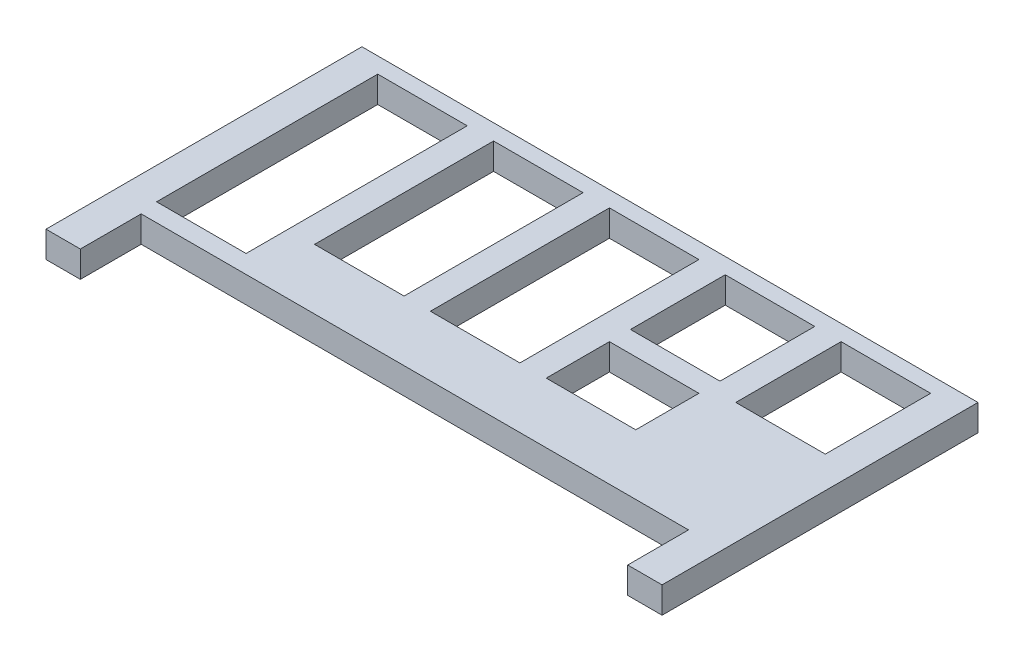
ISO-10303-21;
HEADER;
FILE_DESCRIPTION(('STEP AP214'),'2;1');
FILE_NAME('part.step','',(''),(''),'','','');
FILE_SCHEMA(('AUTOMOTIVE_DESIGN { 1 0 10303 214 1 1 1 1 }'));
ENDSEC;
DATA;
#1=APPLICATION_CONTEXT('core data for automotive mechanical design processes');
#2=APPLICATION_PROTOCOL_DEFINITION('international standard','automotive_design',2000,#1);
#3=PRODUCT_CONTEXT('',#1,'mechanical');
#4=PRODUCT('Part','Part','',(#3));
#5=PRODUCT_RELATED_PRODUCT_CATEGORY('part','',(#4));
#6=PRODUCT_DEFINITION_FORMATION('','',#4);
#7=PRODUCT_DEFINITION_CONTEXT('part definition',#1,'design');
#8=PRODUCT_DEFINITION('design','',#6,#7);
#9=PRODUCT_DEFINITION_SHAPE('','',#8);
#10=(LENGTH_UNIT() NAMED_UNIT(*) SI_UNIT(.MILLI.,.METRE.));
#11=(NAMED_UNIT(*) PLANE_ANGLE_UNIT() SI_UNIT($,.RADIAN.));
#12=(NAMED_UNIT(*) SI_UNIT($,.STERADIAN.) SOLID_ANGLE_UNIT());
#13=UNCERTAINTY_MEASURE_WITH_UNIT(LENGTH_MEASURE(1.E-05),#10,'distance_accuracy_value','');
#14=(GEOMETRIC_REPRESENTATION_CONTEXT(3) GLOBAL_UNCERTAINTY_ASSIGNED_CONTEXT((#13)) GLOBAL_UNIT_ASSIGNED_CONTEXT((#10,
#11,#12)) REPRESENTATION_CONTEXT('',''));
#15=CARTESIAN_POINT('',(0.,0.,0.));
#16=DIRECTION('',(0.,0.,1.));
#17=DIRECTION('',(1.,0.,0.));
#18=AXIS2_PLACEMENT_3D('',#15,#16,#17);
#19=CARTESIAN_POINT('',(0.,5.,-5.));
#20=DIRECTION('',(0.,0.,-1.));
#21=DIRECTION('',(-1.,0.,0.));
#22=AXIS2_PLACEMENT_3D('',#19,#20,#21);
#23=PLANE('',#22);
#24=DIRECTION('',(1.,0.,0.));
#25=VECTOR('',#24,1.);
#26=CARTESIAN_POINT('',(0.,0.,-5.));
#27=LINE('',#26,#25);
#28=CARTESIAN_POINT('',(13.5,0.,-5.));
#29=VERTEX_POINT('',#28);
#30=CARTESIAN_POINT('',(30.5,0.,-5.));
#31=VERTEX_POINT('',#30);
#32=EDGE_CURVE('E354',#29,#31,#27,.T.);
#33=ORIENTED_EDGE('',*,*,#32,.T.);
#34=DIRECTION('',(0.,-1.,0.));
#35=VECTOR('',#34,1.);
#36=CARTESIAN_POINT('',(30.5,5.,-5.));
#37=LINE('',#36,#35);
#38=CARTESIAN_POINT('',(30.5,5.,-5.));
#39=VERTEX_POINT('',#38);
#40=EDGE_CURVE('E11',#39,#31,#37,.T.);
#41=ORIENTED_EDGE('',*,*,#40,.F.);
#42=DIRECTION('',(1.,0.,0.));
#43=VECTOR('',#42,1.);
#44=CARTESIAN_POINT('',(0.,5.,-5.));
#45=LINE('',#44,#43);
#46=CARTESIAN_POINT('',(13.5,5.,-5.));
#47=VERTEX_POINT('',#46);
#48=EDGE_CURVE('E257',#47,#39,#45,.T.);
#49=ORIENTED_EDGE('',*,*,#48,.F.);
#50=DIRECTION('',(0.,-1.,0.));
#51=VECTOR('',#50,1.);
#52=CARTESIAN_POINT('',(13.5,5.,-5.));
#53=LINE('',#52,#51);
#54=EDGE_CURVE('E53',#47,#29,#53,.T.);
#55=ORIENTED_EDGE('',*,*,#54,.T.);
#56=EDGE_LOOP('',(#33,#41,#49,#55));
#57=FACE_BOUND('',#56,.T.);
#58=ADVANCED_FACE('F34',(#57),#23,.F.);
#59=CARTESIAN_POINT('',(30.5,5.,0.));
#60=DIRECTION('',(1.,0.,0.));
#61=DIRECTION('',(0.,0.,-1.));
#62=AXIS2_PLACEMENT_3D('',#59,#60,#61);
#63=PLANE('',#62);
#64=DIRECTION('',(0.,0.,1.));
#65=VECTOR('',#64,1.);
#66=CARTESIAN_POINT('',(30.5,0.,0.));
#67=LINE('',#66,#65);
#68=CARTESIAN_POINT('',(30.5,0.,7.));
#69=VERTEX_POINT('',#68);
#70=EDGE_CURVE('E263',#31,#69,#67,.T.);
#71=ORIENTED_EDGE('',*,*,#70,.T.);
#72=DIRECTION('',(0.,-1.,0.));
#73=VECTOR('',#72,1.);
#74=CARTESIAN_POINT('',(30.5,5.,7.));
#75=LINE('',#74,#73);
#76=CARTESIAN_POINT('',(30.5,5.,7.));
#77=VERTEX_POINT('',#76);
#78=EDGE_CURVE('E44',#77,#69,#75,.T.);
#79=ORIENTED_EDGE('',*,*,#78,.F.);
#80=DIRECTION('',(0.,0.,1.));
#81=VECTOR('',#80,1.);
#82=CARTESIAN_POINT('',(30.5,5.,0.));
#83=LINE('',#82,#81);
#84=EDGE_CURVE('E251',#39,#77,#83,.T.);
#85=ORIENTED_EDGE('',*,*,#84,.F.);
#86=ORIENTED_EDGE('',*,*,#40,.T.);
#87=EDGE_LOOP('',(#71,#79,#85,#86));
#88=FACE_BOUND('',#87,.T.);
#89=ADVANCED_FACE('F262',(#88),#63,.F.);
#90=CARTESIAN_POINT('',(0.,5.,7.));
#91=DIRECTION('',(0.,0.,-1.));
#92=DIRECTION('',(-1.,0.,0.));
#93=AXIS2_PLACEMENT_3D('',#90,#91,#92);
#94=PLANE('',#93);
#95=DIRECTION('',(1.,0.,0.));
#96=VECTOR('',#95,1.);
#97=CARTESIAN_POINT('',(0.,0.,7.));
#98=LINE('',#97,#96);
#99=CARTESIAN_POINT('',(13.5,0.,7.));
#100=VERTEX_POINT('',#99);
#101=EDGE_CURVE('E357',#100,#69,#98,.T.);
#102=ORIENTED_EDGE('',*,*,#101,.F.);
#103=DIRECTION('',(0.,-1.,0.));
#104=VECTOR('',#103,1.);
#105=CARTESIAN_POINT('',(13.5,5.,7.));
#106=LINE('',#105,#104);
#107=CARTESIAN_POINT('',(13.5,5.,7.));
#108=VERTEX_POINT('',#107);
#109=EDGE_CURVE('E151',#108,#100,#106,.T.);
#110=ORIENTED_EDGE('',*,*,#109,.F.);
#111=DIRECTION('',(1.,0.,0.));
#112=VECTOR('',#111,1.);
#113=CARTESIAN_POINT('',(0.,5.,7.));
#114=LINE('',#113,#112);
#115=EDGE_CURVE('E256',#108,#77,#114,.T.);
#116=ORIENTED_EDGE('',*,*,#115,.T.);
#117=ORIENTED_EDGE('',*,*,#78,.T.);
#118=EDGE_LOOP('',(#102,#110,#116,#117));
#119=FACE_BOUND('',#118,.T.);
#120=ADVANCED_FACE('F267',(#119),#94,.T.);
#121=CARTESIAN_POINT('',(-35.5,5.,0.));
#122=DIRECTION('',(-1.,0.,0.));
#123=DIRECTION('',(0.,0.,1.));
#124=AXIS2_PLACEMENT_3D('',#121,#122,#123);
#125=PLANE('',#124);
#126=DIRECTION('',(0.,0.,-1.));
#127=VECTOR('',#126,1.);
#128=CARTESIAN_POINT('',(-35.5,0.,0.));
#129=LINE('',#128,#127);
#130=CARTESIAN_POINT('',(-35.5,0.,15.));
#131=VERTEX_POINT('',#130);
#132=CARTESIAN_POINT('',(-35.5,0.,-27.));
#133=VERTEX_POINT('',#132);
#134=EDGE_CURVE('E342',#131,#133,#129,.T.);
#135=ORIENTED_EDGE('',*,*,#134,.F.);
#136=DIRECTION('',(0.,-1.,0.));
#137=VECTOR('',#136,1.);
#138=CARTESIAN_POINT('',(-35.5,5.,15.));
#139=LINE('',#138,#137);
#140=CARTESIAN_POINT('',(-35.5,5.,15.));
#141=VERTEX_POINT('',#140);
#142=EDGE_CURVE('E364',#141,#131,#139,.T.);
#143=ORIENTED_EDGE('',*,*,#142,.F.);
#144=DIRECTION('',(0.,0.,-1.));
#145=VECTOR('',#144,1.);
#146=CARTESIAN_POINT('',(-35.5,5.,0.));
#147=LINE('',#146,#145);
#148=CARTESIAN_POINT('',(-35.5,5.,-27.));
#149=VERTEX_POINT('',#148);
#150=EDGE_CURVE('E809',#141,#149,#147,.T.);
#151=ORIENTED_EDGE('',*,*,#150,.T.);
#152=DIRECTION('',(0.,-1.,0.));
#153=VECTOR('',#152,1.);
#154=CARTESIAN_POINT('',(-35.5,5.,-27.));
#155=LINE('',#154,#153);
#156=EDGE_CURVE('E366',#149,#133,#155,.T.);
#157=ORIENTED_EDGE('',*,*,#156,.T.);
#158=EDGE_LOOP('',(#135,#143,#151,#157));
#159=FACE_BOUND('',#158,.T.);
#160=ADVANCED_FACE('F495',(#159),#125,.T.);
#161=CARTESIAN_POINT('',(0.,5.,15.));
#162=DIRECTION('',(0.,0.,-1.));
#163=DIRECTION('',(-1.,0.,0.));
#164=AXIS2_PLACEMENT_3D('',#161,#162,#163);
#165=PLANE('',#164);
#166=DIRECTION('',(1.,0.,0.));
#167=VECTOR('',#166,1.);
#168=CARTESIAN_POINT('',(0.,0.,15.));
#169=LINE('',#168,#167);
#170=CARTESIAN_POINT('',(-52.5,0.,15.));
#171=VERTEX_POINT('',#170);
#172=EDGE_CURVE('E345',#171,#131,#169,.T.);
#173=ORIENTED_EDGE('',*,*,#172,.F.);
#174=DIRECTION('',(0.,-1.,0.));
#175=VECTOR('',#174,1.);
#176=CARTESIAN_POINT('',(-52.5,5.,15.));
#177=LINE('',#176,#175);
#178=CARTESIAN_POINT('',(-52.5,5.,15.));
#179=VERTEX_POINT('',#178);
#180=EDGE_CURVE('E372',#179,#171,#177,.T.);
#181=ORIENTED_EDGE('',*,*,#180,.F.);
#182=DIRECTION('',(1.,0.,0.));
#183=VECTOR('',#182,1.);
#184=CARTESIAN_POINT('',(0.,5.,15.));
#185=LINE('',#184,#183);
#186=EDGE_CURVE('E812',#179,#141,#185,.T.);
#187=ORIENTED_EDGE('',*,*,#186,.T.);
#188=ORIENTED_EDGE('',*,*,#142,.T.);
#189=EDGE_LOOP('',(#173,#181,#187,#188));
#190=FACE_BOUND('',#189,.T.);
#191=ADVANCED_FACE('F491',(#190),#165,.T.);
#192=CARTESIAN_POINT('',(-52.5,5.,0.));
#193=DIRECTION('',(-1.,0.,0.));
#194=DIRECTION('',(0.,0.,1.));
#195=AXIS2_PLACEMENT_3D('',#192,#193,#194);
#196=PLANE('',#195);
#197=DIRECTION('',(0.,0.,-1.));
#198=VECTOR('',#197,1.);
#199=CARTESIAN_POINT('',(-52.5,0.,0.));
#200=LINE('',#199,#198);
#201=CARTESIAN_POINT('',(-52.5,0.,-27.));
#202=VERTEX_POINT('',#201);
#203=EDGE_CURVE('E348',#171,#202,#200,.T.);
#204=ORIENTED_EDGE('',*,*,#203,.T.);
#205=DIRECTION('',(0.,-1.,0.));
#206=VECTOR('',#205,1.);
#207=CARTESIAN_POINT('',(-52.5,5.,-27.));
#208=LINE('',#207,#206);
#209=CARTESIAN_POINT('',(-52.5,5.,-27.));
#210=VERTEX_POINT('',#209);
#211=EDGE_CURVE('E368',#210,#202,#208,.T.);
#212=ORIENTED_EDGE('',*,*,#211,.F.);
#213=DIRECTION('',(0.,0.,-1.));
#214=VECTOR('',#213,1.);
#215=CARTESIAN_POINT('',(-52.5,5.,0.));
#216=LINE('',#215,#214);
#217=EDGE_CURVE('E820',#179,#210,#216,.T.);
#218=ORIENTED_EDGE('',*,*,#217,.F.);
#219=ORIENTED_EDGE('',*,*,#180,.T.);
#220=EDGE_LOOP('',(#204,#212,#218,#219));
#221=FACE_BOUND('',#220,.T.);
#222=ADVANCED_FACE('F487',(#221),#196,.F.);
#223=CARTESIAN_POINT('',(-30.5,5.,0.));
#224=DIRECTION('',(1.,0.,0.));
#225=DIRECTION('',(0.,0.,-1.));
#226=AXIS2_PLACEMENT_3D('',#223,#224,#225);
#227=PLANE('',#226);
#228=DIRECTION('',(0.,0.,1.));
#229=VECTOR('',#228,1.);
#230=CARTESIAN_POINT('',(-30.5,0.,0.));
#231=LINE('',#230,#229);
#232=CARTESIAN_POINT('',(-30.5,0.,-27.));
#233=VERTEX_POINT('',#232);
#234=CARTESIAN_POINT('',(-30.5,0.,6.99999999999999));
#235=VERTEX_POINT('',#234);
#236=EDGE_CURVE('E330',#233,#235,#231,.T.);
#237=ORIENTED_EDGE('',*,*,#236,.F.);
#238=DIRECTION('',(0.,-1.,0.));
#239=VECTOR('',#238,1.);
#240=CARTESIAN_POINT('',(-30.5,5.,-27.));
#241=LINE('',#240,#239);
#242=CARTESIAN_POINT('',(-30.5,5.,-27.));
#243=VERTEX_POINT('',#242);
#244=EDGE_CURVE('E369',#243,#233,#241,.T.);
#245=ORIENTED_EDGE('',*,*,#244,.F.);
#246=DIRECTION('',(0.,0.,1.));
#247=VECTOR('',#246,1.);
#248=CARTESIAN_POINT('',(-30.5,5.,0.));
#249=LINE('',#248,#247);
#250=CARTESIAN_POINT('',(-30.5,5.,6.99999999999999));
#251=VERTEX_POINT('',#250);
#252=EDGE_CURVE('E804',#243,#251,#249,.T.);
#253=ORIENTED_EDGE('',*,*,#252,.T.);
#254=DIRECTION('',(0.,-1.,0.));
#255=VECTOR('',#254,1.);
#256=CARTESIAN_POINT('',(-30.5,5.,6.99999999999999));
#257=LINE('',#256,#255);
#258=EDGE_CURVE('E375',#251,#235,#257,.T.);
#259=ORIENTED_EDGE('',*,*,#258,.T.);
#260=EDGE_LOOP('',(#237,#245,#253,#259));
#261=FACE_BOUND('',#260,.T.);
#262=ADVANCED_FACE('F490',(#261),#227,.T.);
#263=CARTESIAN_POINT('',(0.,5.,-27.));
#264=DIRECTION('',(0.,0.,1.));
#265=DIRECTION('',(1.,0.,0.));
#266=AXIS2_PLACEMENT_3D('',#263,#264,#265);
#267=PLANE('',#266);
#268=DIRECTION('',(-1.,0.,0.));
#269=VECTOR('',#268,1.);
#270=CARTESIAN_POINT('',(0.,0.,-27.));
#271=LINE('',#270,#269);
#272=CARTESIAN_POINT('',(-13.5,0.,-27.));
#273=VERTEX_POINT('',#272);
#274=EDGE_CURVE('E333',#273,#233,#271,.T.);
#275=ORIENTED_EDGE('',*,*,#274,.F.);
#276=DIRECTION('',(0.,-1.,0.));
#277=VECTOR('',#276,1.);
#278=CARTESIAN_POINT('',(-13.5,5.,-27.));
#279=LINE('',#278,#277);
#280=CARTESIAN_POINT('',(-13.5,5.,-27.));
#281=VERTEX_POINT('',#280);
#282=EDGE_CURVE('E381',#281,#273,#279,.T.);
#283=ORIENTED_EDGE('',*,*,#282,.F.);
#284=DIRECTION('',(-1.,0.,0.));
#285=VECTOR('',#284,1.);
#286=CARTESIAN_POINT('',(0.,5.,-27.));
#287=LINE('',#286,#285);
#288=EDGE_CURVE('E829',#281,#243,#287,.T.);
#289=ORIENTED_EDGE('',*,*,#288,.T.);
#290=ORIENTED_EDGE('',*,*,#244,.T.);
#291=EDGE_LOOP('',(#275,#283,#289,#290));
#292=FACE_BOUND('',#291,.T.);
#293=ADVANCED_FACE('F508',(#292),#267,.T.);
#294=CARTESIAN_POINT('',(-13.5,5.,0.));
#295=DIRECTION('',(1.,0.,0.));
#296=DIRECTION('',(0.,0.,-1.));
#297=AXIS2_PLACEMENT_3D('',#294,#295,#296);
#298=PLANE('',#297);
#299=DIRECTION('',(0.,0.,1.));
#300=VECTOR('',#299,1.);
#301=CARTESIAN_POINT('',(-13.5,0.,0.));
#302=LINE('',#301,#300);
#303=CARTESIAN_POINT('',(-13.5,0.,6.99999999999999));
#304=VERTEX_POINT('',#303);
#305=EDGE_CURVE('E336',#273,#304,#302,.T.);
#306=ORIENTED_EDGE('',*,*,#305,.T.);
#307=DIRECTION('',(0.,-1.,0.));
#308=VECTOR('',#307,1.);
#309=CARTESIAN_POINT('',(-13.5,5.,6.99999999999999));
#310=LINE('',#309,#308);
#311=CARTESIAN_POINT('',(-13.5,5.,6.99999999999999));
#312=VERTEX_POINT('',#311);
#313=EDGE_CURVE('E377',#312,#304,#310,.T.);
#314=ORIENTED_EDGE('',*,*,#313,.F.);
#315=DIRECTION('',(0.,0.,1.));
#316=VECTOR('',#315,1.);
#317=CARTESIAN_POINT('',(-13.5,5.,0.));
#318=LINE('',#317,#316);
#319=EDGE_CURVE('E826',#281,#312,#318,.T.);
#320=ORIENTED_EDGE('',*,*,#319,.F.);
#321=ORIENTED_EDGE('',*,*,#282,.T.);
#322=EDGE_LOOP('',(#306,#314,#320,#321));
#323=FACE_BOUND('',#322,.T.);
#324=ADVANCED_FACE('F504',(#323),#298,.F.);
#325=CARTESIAN_POINT('',(30.5,5.,0.));
#326=DIRECTION('',(-1.,0.,0.));
#327=DIRECTION('',(0.,0.,1.));
#328=AXIS2_PLACEMENT_3D('',#325,#326,#327);
#329=PLANE('',#328);
#330=DIRECTION('',(0.,0.,-1.));
#331=VECTOR('',#330,1.);
#332=CARTESIAN_POINT('',(30.5,0.,0.));
#333=LINE('',#332,#331);
#334=CARTESIAN_POINT('',(30.5,0.,-9.));
#335=VERTEX_POINT('',#334);
#336=CARTESIAN_POINT('',(30.5,0.,-27.));
#337=VERTEX_POINT('',#336);
#338=EDGE_CURVE('E318',#335,#337,#333,.T.);
#339=ORIENTED_EDGE('',*,*,#338,.F.);
#340=DIRECTION('',(0.,-1.,0.));
#341=VECTOR('',#340,1.);
#342=CARTESIAN_POINT('',(30.5,5.,-9.));
#343=LINE('',#342,#341);
#344=CARTESIAN_POINT('',(30.5,5.,-9.));
#345=VERTEX_POINT('',#344);
#346=EDGE_CURVE('E378',#345,#335,#343,.T.);
#347=ORIENTED_EDGE('',*,*,#346,.F.);
#348=DIRECTION('',(0.,0.,-1.));
#349=VECTOR('',#348,1.);
#350=CARTESIAN_POINT('',(30.5,5.,0.));
#351=LINE('',#350,#349);
#352=CARTESIAN_POINT('',(30.5,5.,-27.));
#353=VERTEX_POINT('',#352);
#354=EDGE_CURVE('E798',#345,#353,#351,.T.);
#355=ORIENTED_EDGE('',*,*,#354,.T.);
#356=DIRECTION('',(0.,-1.,0.));
#357=VECTOR('',#356,1.);
#358=CARTESIAN_POINT('',(30.5,5.,-27.));
#359=LINE('',#358,#357);
#360=EDGE_CURVE('E384',#353,#337,#359,.T.);
#361=ORIENTED_EDGE('',*,*,#360,.T.);
#362=EDGE_LOOP('',(#339,#347,#355,#361));
#363=FACE_BOUND('',#362,.T.);
#364=ADVANCED_FACE('F507',(#363),#329,.T.);
#365=CARTESIAN_POINT('',(0.,5.,-9.));
#366=DIRECTION('',(0.,0.,-1.));
#367=DIRECTION('',(-1.,0.,0.));
#368=AXIS2_PLACEMENT_3D('',#365,#366,#367);
#369=PLANE('',#368);
#370=DIRECTION('',(1.,0.,0.));
#371=VECTOR('',#370,1.);
#372=CARTESIAN_POINT('',(0.,0.,-9.));
#373=LINE('',#372,#371);
#374=CARTESIAN_POINT('',(13.5,0.,-9.));
#375=VERTEX_POINT('',#374);
#376=EDGE_CURVE('E321',#375,#335,#373,.T.);
#377=ORIENTED_EDGE('',*,*,#376,.F.);
#378=DIRECTION('',(0.,-1.,0.));
#379=VECTOR('',#378,1.);
#380=CARTESIAN_POINT('',(13.5,5.,-9.));
#381=LINE('',#380,#379);
#382=CARTESIAN_POINT('',(13.5,5.,-9.));
#383=VERTEX_POINT('',#382);
#384=EDGE_CURVE('E390',#383,#375,#381,.T.);
#385=ORIENTED_EDGE('',*,*,#384,.F.);
#386=DIRECTION('',(1.,0.,0.));
#387=VECTOR('',#386,1.);
#388=CARTESIAN_POINT('',(0.,5.,-9.));
#389=LINE('',#388,#387);
#390=EDGE_CURVE('E837',#383,#345,#389,.T.);
#391=ORIENTED_EDGE('',*,*,#390,.T.);
#392=ORIENTED_EDGE('',*,*,#346,.T.);
#393=EDGE_LOOP('',(#377,#385,#391,#392));
#394=FACE_BOUND('',#393,.T.);
#395=ADVANCED_FACE('F524',(#394),#369,.T.);
#396=CARTESIAN_POINT('',(13.5,5.,0.));
#397=DIRECTION('',(-1.,0.,0.));
#398=DIRECTION('',(0.,0.,1.));
#399=AXIS2_PLACEMENT_3D('',#396,#397,#398);
#400=PLANE('',#399);
#401=DIRECTION('',(0.,0.,-1.));
#402=VECTOR('',#401,1.);
#403=CARTESIAN_POINT('',(13.5,0.,0.));
#404=LINE('',#403,#402);
#405=CARTESIAN_POINT('',(13.5,0.,-27.));
#406=VERTEX_POINT('',#405);
#407=EDGE_CURVE('E324',#375,#406,#404,.T.);
#408=ORIENTED_EDGE('',*,*,#407,.T.);
#409=DIRECTION('',(0.,-1.,0.));
#410=VECTOR('',#409,1.);
#411=CARTESIAN_POINT('',(13.5,5.,-27.));
#412=LINE('',#411,#410);
#413=CARTESIAN_POINT('',(13.5,5.,-27.));
#414=VERTEX_POINT('',#413);
#415=EDGE_CURVE('E386',#414,#406,#412,.T.);
#416=ORIENTED_EDGE('',*,*,#415,.F.);
#417=DIRECTION('',(0.,0.,-1.));
#418=VECTOR('',#417,1.);
#419=CARTESIAN_POINT('',(13.5,5.,0.));
#420=LINE('',#419,#418);
#421=EDGE_CURVE('E834',#383,#414,#420,.T.);
#422=ORIENTED_EDGE('',*,*,#421,.F.);
#423=ORIENTED_EDGE('',*,*,#384,.T.);
#424=EDGE_LOOP('',(#408,#416,#422,#423));
#425=FACE_BOUND('',#424,.T.);
#426=ADVANCED_FACE('F520',(#425),#400,.F.);
#427=CARTESIAN_POINT('',(8.50000000000002,5.,0.));
#428=DIRECTION('',(-1.,0.,0.));
#429=DIRECTION('',(0.,0.,1.));
#430=AXIS2_PLACEMENT_3D('',#427,#428,#429);
#431=PLANE('',#430);
#432=DIRECTION('',(0.,0.,-1.));
#433=VECTOR('',#432,1.);
#434=CARTESIAN_POINT('',(8.50000000000002,0.,0.));
#435=LINE('',#434,#433);
#436=CARTESIAN_POINT('',(8.50000000000002,0.,7.));
#437=VERTEX_POINT('',#436);
#438=CARTESIAN_POINT('',(8.50000000000002,0.,-27.));
#439=VERTEX_POINT('',#438);
#440=EDGE_CURVE('E306',#437,#439,#435,.T.);
#441=ORIENTED_EDGE('',*,*,#440,.F.);
#442=DIRECTION('',(0.,-1.,0.));
#443=VECTOR('',#442,1.);
#444=CARTESIAN_POINT('',(8.50000000000002,5.,7.));
#445=LINE('',#444,#443);
#446=CARTESIAN_POINT('',(8.50000000000002,5.,7.));
#447=VERTEX_POINT('',#446);
#448=EDGE_CURVE('E387',#447,#437,#445,.T.);
#449=ORIENTED_EDGE('',*,*,#448,.F.);
#450=DIRECTION('',(0.,0.,-1.));
#451=VECTOR('',#450,1.);
#452=CARTESIAN_POINT('',(8.50000000000002,5.,0.));
#453=LINE('',#452,#451);
#454=CARTESIAN_POINT('',(8.50000000000002,5.,-27.));
#455=VERTEX_POINT('',#454);
#456=EDGE_CURVE('E792',#447,#455,#453,.T.);
#457=ORIENTED_EDGE('',*,*,#456,.T.);
#458=DIRECTION('',(0.,-1.,0.));
#459=VECTOR('',#458,1.);
#460=CARTESIAN_POINT('',(8.50000000000002,5.,-27.));
#461=LINE('',#460,#459);
#462=EDGE_CURVE('E393',#455,#439,#461,.T.);
#463=ORIENTED_EDGE('',*,*,#462,.T.);
#464=EDGE_LOOP('',(#441,#449,#457,#463));
#465=FACE_BOUND('',#464,.T.);
#466=ADVANCED_FACE('F523',(#465),#431,.T.);
#467=CARTESIAN_POINT('',(0.,5.,7.));
#468=DIRECTION('',(0.,0.,-1.));
#469=DIRECTION('',(-1.,0.,0.));
#470=AXIS2_PLACEMENT_3D('',#467,#468,#469);
#471=PLANE('',#470);
#472=DIRECTION('',(1.,0.,0.));
#473=VECTOR('',#472,1.);
#474=CARTESIAN_POINT('',(0.,0.,7.));
#475=LINE('',#474,#473);
#476=CARTESIAN_POINT('',(-8.49999999999998,0.,7.));
#477=VERTEX_POINT('',#476);
#478=EDGE_CURVE('E309',#477,#437,#475,.T.);
#479=ORIENTED_EDGE('',*,*,#478,.F.);
#480=DIRECTION('',(0.,-1.,0.));
#481=VECTOR('',#480,1.);
#482=CARTESIAN_POINT('',(-8.49999999999998,5.,7.));
#483=LINE('',#482,#481);
#484=CARTESIAN_POINT('',(-8.49999999999998,5.,7.));
#485=VERTEX_POINT('',#484);
#486=EDGE_CURVE('E399',#485,#477,#483,.T.);
#487=ORIENTED_EDGE('',*,*,#486,.F.);
#488=DIRECTION('',(1.,0.,0.));
#489=VECTOR('',#488,1.);
#490=CARTESIAN_POINT('',(0.,5.,7.));
#491=LINE('',#490,#489);
#492=EDGE_CURVE('E845',#485,#447,#491,.T.);
#493=ORIENTED_EDGE('',*,*,#492,.T.);
#494=ORIENTED_EDGE('',*,*,#448,.T.);
#495=EDGE_LOOP('',(#479,#487,#493,#494));
#496=FACE_BOUND('',#495,.T.);
#497=ADVANCED_FACE('F540',(#496),#471,.T.);
#498=CARTESIAN_POINT('',(-8.49999999999998,5.,0.));
#499=DIRECTION('',(-1.,0.,0.));
#500=DIRECTION('',(0.,0.,1.));
#501=AXIS2_PLACEMENT_3D('',#498,#499,#500);
#502=PLANE('',#501);
#503=DIRECTION('',(0.,0.,-1.));
#504=VECTOR('',#503,1.);
#505=CARTESIAN_POINT('',(-8.49999999999998,0.,0.));
#506=LINE('',#505,#504);
#507=CARTESIAN_POINT('',(-8.49999999999998,0.,-27.));
#508=VERTEX_POINT('',#507);
#509=EDGE_CURVE('E312',#477,#508,#506,.T.);
#510=ORIENTED_EDGE('',*,*,#509,.T.);
#511=DIRECTION('',(0.,-1.,0.));
#512=VECTOR('',#511,1.);
#513=CARTESIAN_POINT('',(-8.49999999999998,5.,-27.));
#514=LINE('',#513,#512);
#515=CARTESIAN_POINT('',(-8.49999999999998,5.,-27.));
#516=VERTEX_POINT('',#515);
#517=EDGE_CURVE('E395',#516,#508,#514,.T.);
#518=ORIENTED_EDGE('',*,*,#517,.F.);
#519=DIRECTION('',(0.,0.,-1.));
#520=VECTOR('',#519,1.);
#521=CARTESIAN_POINT('',(-8.49999999999998,5.,0.));
#522=LINE('',#521,#520);
#523=EDGE_CURVE('E842',#485,#516,#522,.T.);
#524=ORIENTED_EDGE('',*,*,#523,.F.);
#525=ORIENTED_EDGE('',*,*,#486,.T.);
#526=EDGE_LOOP('',(#510,#518,#524,#525));
#527=FACE_BOUND('',#526,.T.);
#528=ADVANCED_FACE('F536',(#527),#502,.F.);
#529=CARTESIAN_POINT('',(52.5,5.,0.));
#530=DIRECTION('',(-1.,0.,0.));
#531=DIRECTION('',(0.,0.,1.));
#532=AXIS2_PLACEMENT_3D('',#529,#530,#531);
#533=PLANE('',#532);
#534=DIRECTION('',(0.,0.,-1.));
#535=VECTOR('',#534,1.);
#536=CARTESIAN_POINT('',(52.5,0.,0.));
#537=LINE('',#536,#535);
#538=CARTESIAN_POINT('',(52.5,0.,-6.99999999999999));
#539=VERTEX_POINT('',#538);
#540=CARTESIAN_POINT('',(52.5,0.,-27.));
#541=VERTEX_POINT('',#540);
#542=EDGE_CURVE('E294',#539,#541,#537,.T.);
#543=ORIENTED_EDGE('',*,*,#542,.F.);
#544=DIRECTION('',(0.,-1.,0.));
#545=VECTOR('',#544,1.);
#546=CARTESIAN_POINT('',(52.5,5.,-6.99999999999999));
#547=LINE('',#546,#545);
#548=CARTESIAN_POINT('',(52.5,5.,-6.99999999999999));
#549=VERTEX_POINT('',#548);
#550=EDGE_CURVE('E396',#549,#539,#547,.T.);
#551=ORIENTED_EDGE('',*,*,#550,.F.);
#552=DIRECTION('',(0.,0.,-1.));
#553=VECTOR('',#552,1.);
#554=CARTESIAN_POINT('',(52.5,5.,0.));
#555=LINE('',#554,#553);
#556=CARTESIAN_POINT('',(52.5,5.,-27.));
#557=VERTEX_POINT('',#556);
#558=EDGE_CURVE('E786',#549,#557,#555,.T.);
#559=ORIENTED_EDGE('',*,*,#558,.T.);
#560=DIRECTION('',(0.,-1.,0.));
#561=VECTOR('',#560,1.);
#562=CARTESIAN_POINT('',(52.5,5.,-27.));
#563=LINE('',#562,#561);
#564=EDGE_CURVE('E402',#557,#541,#563,.T.);
#565=ORIENTED_EDGE('',*,*,#564,.T.);
#566=EDGE_LOOP('',(#543,#551,#559,#565));
#567=FACE_BOUND('',#566,.T.);
#568=ADVANCED_FACE('F539',(#567),#533,.T.);
#569=CARTESIAN_POINT('',(0.,5.,-6.99999999999999));
#570=DIRECTION('',(0.,0.,-1.));
#571=DIRECTION('',(-1.,0.,0.));
#572=AXIS2_PLACEMENT_3D('',#569,#570,#571);
#573=PLANE('',#572);
#574=DIRECTION('',(1.,0.,0.));
#575=VECTOR('',#574,1.);
#576=CARTESIAN_POINT('',(0.,0.,-6.99999999999999));
#577=LINE('',#576,#575);
#578=CARTESIAN_POINT('',(35.5,0.,-6.99999999999999));
#579=VERTEX_POINT('',#578);
#580=EDGE_CURVE('E297',#579,#539,#577,.T.);
#581=ORIENTED_EDGE('',*,*,#580,.F.);
#582=DIRECTION('',(0.,-1.,0.));
#583=VECTOR('',#582,1.);
#584=CARTESIAN_POINT('',(35.5,5.,-6.99999999999999));
#585=LINE('',#584,#583);
#586=CARTESIAN_POINT('',(35.5,5.,-6.99999999999999));
#587=VERTEX_POINT('',#586);
#588=EDGE_CURVE('E407',#587,#579,#585,.T.);
#589=ORIENTED_EDGE('',*,*,#588,.F.);
#590=DIRECTION('',(1.,0.,0.));
#591=VECTOR('',#590,1.);
#592=CARTESIAN_POINT('',(0.,5.,-6.99999999999999));
#593=LINE('',#592,#591);
#594=EDGE_CURVE('E853',#587,#549,#593,.T.);
#595=ORIENTED_EDGE('',*,*,#594,.T.);
#596=ORIENTED_EDGE('',*,*,#550,.T.);
#597=EDGE_LOOP('',(#581,#589,#595,#596));
#598=FACE_BOUND('',#597,.T.);
#599=ADVANCED_FACE('F554',(#598),#573,.T.);
#600=CARTESIAN_POINT('',(35.5,5.,0.));
#601=DIRECTION('',(-1.,0.,0.));
#602=DIRECTION('',(0.,0.,1.));
#603=AXIS2_PLACEMENT_3D('',#600,#601,#602);
#604=PLANE('',#603);
#605=DIRECTION('',(0.,0.,-1.));
#606=VECTOR('',#605,1.);
#607=CARTESIAN_POINT('',(35.5,0.,0.));
#608=LINE('',#607,#606);
#609=CARTESIAN_POINT('',(35.5,0.,-27.));
#610=VERTEX_POINT('',#609);
#611=EDGE_CURVE('E300',#579,#610,#608,.T.);
#612=ORIENTED_EDGE('',*,*,#611,.T.);
#613=DIRECTION('',(0.,-1.,0.));
#614=VECTOR('',#613,1.);
#615=CARTESIAN_POINT('',(35.5,5.,-27.));
#616=LINE('',#615,#614);
#617=CARTESIAN_POINT('',(35.5,5.,-27.));
#618=VERTEX_POINT('',#617);
#619=EDGE_CURVE('E404',#618,#610,#616,.T.);
#620=ORIENTED_EDGE('',*,*,#619,.F.);
#621=DIRECTION('',(0.,0.,-1.));
#622=VECTOR('',#621,1.);
#623=CARTESIAN_POINT('',(35.5,5.,0.));
#624=LINE('',#623,#622);
#625=EDGE_CURVE('E850',#587,#618,#624,.T.);
#626=ORIENTED_EDGE('',*,*,#625,.F.);
#627=ORIENTED_EDGE('',*,*,#588,.T.);
#628=EDGE_LOOP('',(#612,#620,#626,#627));
#629=FACE_BOUND('',#628,.T.);
#630=ADVANCED_FACE('F551',(#629),#604,.F.);
#631=CARTESIAN_POINT('',(51.975,5.,0.));
#632=DIRECTION('',(-1.,0.,0.));
#633=DIRECTION('',(0.,0.,1.));
#634=AXIS2_PLACEMENT_3D('',#631,#632,#633);
#635=PLANE('',#634);
#636=DIRECTION('',(0.,0.,-1.));
#637=VECTOR('',#636,1.);
#638=CARTESIAN_POINT('',(51.975,0.,0.));
#639=LINE('',#638,#637);
#640=CARTESIAN_POINT('',(51.975,0.,30.));
#641=VERTEX_POINT('',#640);
#642=CARTESIAN_POINT('',(51.975,0.,18.45));
#643=VERTEX_POINT('',#642);
#644=EDGE_CURVE('E274',#641,#643,#639,.T.);
#645=ORIENTED_EDGE('',*,*,#644,.F.);
#646=DIRECTION('',(0.,-1.,0.));
#647=VECTOR('',#646,1.);
#648=CARTESIAN_POINT('',(51.975,5.,30.));
#649=LINE('',#648,#647);
#650=CARTESIAN_POINT('',(51.975,5.,30.));
#651=VERTEX_POINT('',#650);
#652=EDGE_CURVE('E38',#651,#641,#649,.T.);
#653=ORIENTED_EDGE('',*,*,#652,.F.);
#654=DIRECTION('',(0.,0.,-1.));
#655=VECTOR('',#654,1.);
#656=CARTESIAN_POINT('',(51.975,5.,0.));
#657=LINE('',#656,#655);
#658=CARTESIAN_POINT('',(51.975,5.,18.45));
#659=VERTEX_POINT('',#658);
#660=EDGE_CURVE('E362',#651,#659,#657,.T.);
#661=ORIENTED_EDGE('',*,*,#660,.T.);
#662=DIRECTION('',(0.,-1.,0.));
#663=VECTOR('',#662,1.);
#664=CARTESIAN_POINT('',(51.975,5.,18.45));
#665=LINE('',#664,#663);
#666=EDGE_CURVE('E270',#659,#643,#665,.T.);
#667=ORIENTED_EDGE('',*,*,#666,.T.);
#668=EDGE_LOOP('',(#645,#653,#661,#667));
#669=FACE_BOUND('',#668,.T.);
#670=ADVANCED_FACE('F36',(#669),#635,.T.);
#671=CARTESIAN_POINT('',(0.,5.,30.));
#672=DIRECTION('',(0.,0.,-1.));
#673=DIRECTION('',(-1.,0.,0.));
#674=AXIS2_PLACEMENT_3D('',#671,#672,#673);
#675=PLANE('',#674);
#676=DIRECTION('',(1.,0.,0.));
#677=VECTOR('',#676,1.);
#678=CARTESIAN_POINT('',(0.,0.,30.));
#679=LINE('',#678,#677);
#680=CARTESIAN_POINT('',(58.5,0.,30.));
#681=VERTEX_POINT('',#680);
#682=EDGE_CURVE('E277',#641,#681,#679,.T.);
#683=ORIENTED_EDGE('',*,*,#682,.T.);
#684=DIRECTION('',(0.,-1.,0.));
#685=VECTOR('',#684,1.);
#686=CARTESIAN_POINT('',(58.5,5.,30.));
#687=LINE('',#686,#685);
#688=CARTESIAN_POINT('',(58.5,5.,30.));
#689=VERTEX_POINT('',#688);
#690=EDGE_CURVE('E422',#689,#681,#687,.T.);
#691=ORIENTED_EDGE('',*,*,#690,.F.);
#692=DIRECTION('',(1.,0.,0.));
#693=VECTOR('',#692,1.);
#694=CARTESIAN_POINT('',(0.,5.,30.));
#695=LINE('',#694,#693);
#696=EDGE_CURVE('E431',#651,#689,#695,.T.);
#697=ORIENTED_EDGE('',*,*,#696,.F.);
#698=ORIENTED_EDGE('',*,*,#652,.T.);
#699=EDGE_LOOP('',(#683,#691,#697,#698));
#700=FACE_BOUND('',#699,.T.);
#701=ADVANCED_FACE('F430',(#700),#675,.F.);
#702=CARTESIAN_POINT('',(58.5,5.,0.));
#703=DIRECTION('',(-1.,0.,0.));
#704=DIRECTION('',(0.,0.,1.));
#705=AXIS2_PLACEMENT_3D('',#702,#703,#704);
#706=PLANE('',#705);
#707=DIRECTION('',(0.,0.,-1.));
#708=VECTOR('',#707,1.);
#709=CARTESIAN_POINT('',(58.5,0.,0.));
#710=LINE('',#709,#708);
#711=CARTESIAN_POINT('',(58.5,0.,-30.));
#712=VERTEX_POINT('',#711);
#713=EDGE_CURVE('E279',#681,#712,#710,.T.);
#714=ORIENTED_EDGE('',*,*,#713,.T.);
#715=DIRECTION('',(0.,-1.,0.));
#716=VECTOR('',#715,1.);
#717=CARTESIAN_POINT('',(58.5,5.,-30.));
#718=LINE('',#717,#716);
#719=CARTESIAN_POINT('',(58.5,5.,-30.));
#720=VERTEX_POINT('',#719);
#721=EDGE_CURVE('E421',#720,#712,#718,.T.);
#722=ORIENTED_EDGE('',*,*,#721,.F.);
#723=DIRECTION('',(0.,0.,-1.));
#724=VECTOR('',#723,1.);
#725=CARTESIAN_POINT('',(58.5,5.,0.));
#726=LINE('',#725,#724);
#727=EDGE_CURVE('E861',#689,#720,#726,.T.);
#728=ORIENTED_EDGE('',*,*,#727,.F.);
#729=ORIENTED_EDGE('',*,*,#690,.T.);
#730=EDGE_LOOP('',(#714,#722,#728,#729));
#731=FACE_BOUND('',#730,.T.);
#732=ADVANCED_FACE('F466',(#731),#706,.F.);
#733=CARTESIAN_POINT('',(0.,5.,-30.));
#734=DIRECTION('',(0.,0.,-1.));
#735=DIRECTION('',(-1.,0.,0.));
#736=AXIS2_PLACEMENT_3D('',#733,#734,#735);
#737=PLANE('',#736);
#738=DIRECTION('',(1.,0.,0.));
#739=VECTOR('',#738,1.);
#740=CARTESIAN_POINT('',(0.,0.,-30.));
#741=LINE('',#740,#739);
#742=CARTESIAN_POINT('',(-58.5,0.,-30.));
#743=VERTEX_POINT('',#742);
#744=EDGE_CURVE('E283',#743,#712,#741,.T.);
#745=ORIENTED_EDGE('',*,*,#744,.F.);
#746=DIRECTION('',(0.,-1.,0.));
#747=VECTOR('',#746,1.);
#748=CARTESIAN_POINT('',(-58.5,5.,-30.));
#749=LINE('',#748,#747);
#750=CARTESIAN_POINT('',(-58.5,5.,-30.));
#751=VERTEX_POINT('',#750);
#752=EDGE_CURVE('E419',#751,#743,#749,.T.);
#753=ORIENTED_EDGE('',*,*,#752,.F.);
#754=DIRECTION('',(1.,0.,0.));
#755=VECTOR('',#754,1.);
#756=CARTESIAN_POINT('',(0.,5.,-30.));
#757=LINE('',#756,#755);
#758=EDGE_CURVE('E465',#751,#720,#757,.T.);
#759=ORIENTED_EDGE('',*,*,#758,.T.);
#760=ORIENTED_EDGE('',*,*,#721,.T.);
#761=EDGE_LOOP('',(#745,#753,#759,#760));
#762=FACE_BOUND('',#761,.T.);
#763=ADVANCED_FACE('F461',(#762),#737,.T.);
#764=CARTESIAN_POINT('',(-58.5,5.,0.));
#765=DIRECTION('',(-1.,0.,0.));
#766=DIRECTION('',(0.,0.,1.));
#767=AXIS2_PLACEMENT_3D('',#764,#765,#766);
#768=PLANE('',#767);
#769=DIRECTION('',(0.,0.,-1.));
#770=VECTOR('',#769,1.);
#771=CARTESIAN_POINT('',(-58.5,0.,0.));
#772=LINE('',#771,#770);
#773=CARTESIAN_POINT('',(-58.5,0.,30.));
#774=VERTEX_POINT('',#773);
#775=EDGE_CURVE('E286',#774,#743,#772,.T.);
#776=ORIENTED_EDGE('',*,*,#775,.F.);
#777=DIRECTION('',(0.,-1.,0.));
#778=VECTOR('',#777,1.);
#779=CARTESIAN_POINT('',(-58.5,5.,30.));
#780=LINE('',#779,#778);
#781=CARTESIAN_POINT('',(-58.5,5.,30.));
#782=VERTEX_POINT('',#781);
#783=EDGE_CURVE('E417',#782,#774,#780,.T.);
#784=ORIENTED_EDGE('',*,*,#783,.F.);
#785=DIRECTION('',(0.,0.,-1.));
#786=VECTOR('',#785,1.);
#787=CARTESIAN_POINT('',(-58.5,5.,0.));
#788=LINE('',#787,#786);
#789=EDGE_CURVE('E458',#782,#751,#788,.T.);
#790=ORIENTED_EDGE('',*,*,#789,.T.);
#791=ORIENTED_EDGE('',*,*,#752,.T.);
#792=EDGE_LOOP('',(#776,#784,#790,#791));
#793=FACE_BOUND('',#792,.T.);
#794=ADVANCED_FACE('F457',(#793),#768,.T.);
#795=CARTESIAN_POINT('',(-51.975,0.,30.));
#796=VERTEX_POINT('',#795);
#797=EDGE_CURVE('E280',#774,#796,#679,.T.);
#798=ORIENTED_EDGE('',*,*,#797,.T.);
#799=DIRECTION('',(0.,-1.,0.));
#800=VECTOR('',#799,1.);
#801=CARTESIAN_POINT('',(-51.975,5.,30.));
#802=LINE('',#801,#800);
#803=CARTESIAN_POINT('',(-51.975,5.,30.));
#804=VERTEX_POINT('',#803);
#805=EDGE_CURVE('E414',#804,#796,#802,.T.);
#806=ORIENTED_EDGE('',*,*,#805,.F.);
#807=EDGE_CURVE('E453',#782,#804,#695,.T.);
#808=ORIENTED_EDGE('',*,*,#807,.F.);
#809=ORIENTED_EDGE('',*,*,#783,.T.);
#810=EDGE_LOOP('',(#798,#806,#808,#809));
#811=FACE_BOUND('',#810,.T.);
#812=ADVANCED_FACE('F452',(#811),#675,.F.);
#813=CARTESIAN_POINT('',(-51.975,5.,0.));
#814=DIRECTION('',(-1.,0.,0.));
#815=DIRECTION('',(0.,0.,1.));
#816=AXIS2_PLACEMENT_3D('',#813,#814,#815);
#817=PLANE('',#816);
#818=DIRECTION('',(0.,0.,-1.));
#819=VECTOR('',#818,1.);
#820=CARTESIAN_POINT('',(-51.975,0.,0.));
#821=LINE('',#820,#819);
#822=CARTESIAN_POINT('',(-51.975,0.,18.45));
#823=VERTEX_POINT('',#822);
#824=EDGE_CURVE('E289',#796,#823,#821,.T.);
#825=ORIENTED_EDGE('',*,*,#824,.T.);
#826=DIRECTION('',(0.,-1.,0.));
#827=VECTOR('',#826,1.);
#828=CARTESIAN_POINT('',(-51.975,5.,18.45));
#829=LINE('',#828,#827);
#830=CARTESIAN_POINT('',(-51.975,5.,18.45));
#831=VERTEX_POINT('',#830);
#832=EDGE_CURVE('E411',#831,#823,#829,.T.);
#833=ORIENTED_EDGE('',*,*,#832,.F.);
#834=DIRECTION('',(0.,0.,-1.));
#835=VECTOR('',#834,1.);
#836=CARTESIAN_POINT('',(-51.975,5.,0.));
#837=LINE('',#836,#835);
#838=EDGE_CURVE('E449',#804,#831,#837,.T.);
#839=ORIENTED_EDGE('',*,*,#838,.F.);
#840=ORIENTED_EDGE('',*,*,#805,.T.);
#841=EDGE_LOOP('',(#825,#833,#839,#840));
#842=FACE_BOUND('',#841,.T.);
#843=ADVANCED_FACE('F446',(#842),#817,.F.);
#844=CARTESIAN_POINT('',(0.,5.,-27.));
#845=DIRECTION('',(0.,0.,-1.));
#846=DIRECTION('',(-1.,0.,0.));
#847=AXIS2_PLACEMENT_3D('',#844,#845,#846);
#848=PLANE('',#847);
#849=DIRECTION('',(1.,0.,0.));
#850=VECTOR('',#849,1.);
#851=CARTESIAN_POINT('',(0.,0.,-27.));
#852=LINE('',#851,#850);
#853=EDGE_CURVE('E351',#202,#133,#852,.T.);
#854=ORIENTED_EDGE('',*,*,#853,.T.);
#855=ORIENTED_EDGE('',*,*,#156,.F.);
#856=DIRECTION('',(1.,0.,0.));
#857=VECTOR('',#856,1.);
#858=CARTESIAN_POINT('',(0.,5.,-27.));
#859=LINE('',#858,#857);
#860=EDGE_CURVE('E813',#210,#149,#859,.T.);
#861=ORIENTED_EDGE('',*,*,#860,.F.);
#862=ORIENTED_EDGE('',*,*,#211,.T.);
#863=EDGE_LOOP('',(#854,#855,#861,#862));
#864=FACE_BOUND('',#863,.T.);
#865=ADVANCED_FACE('F482',(#864),#848,.F.);
#866=CARTESIAN_POINT('',(0.,5.,6.99999999999999));
#867=DIRECTION('',(0.,0.,1.));
#868=DIRECTION('',(1.,0.,0.));
#869=AXIS2_PLACEMENT_3D('',#866,#867,#868);
#870=PLANE('',#869);
#871=DIRECTION('',(-1.,0.,0.));
#872=VECTOR('',#871,1.);
#873=CARTESIAN_POINT('',(0.,0.,6.99999999999999));
#874=LINE('',#873,#872);
#875=EDGE_CURVE('E339',#304,#235,#874,.T.);
#876=ORIENTED_EDGE('',*,*,#875,.T.);
#877=ORIENTED_EDGE('',*,*,#258,.F.);
#878=DIRECTION('',(-1.,0.,0.));
#879=VECTOR('',#878,1.);
#880=CARTESIAN_POINT('',(0.,5.,6.99999999999999));
#881=LINE('',#880,#879);
#882=EDGE_CURVE('E815',#312,#251,#881,.T.);
#883=ORIENTED_EDGE('',*,*,#882,.F.);
#884=ORIENTED_EDGE('',*,*,#313,.T.);
#885=EDGE_LOOP('',(#876,#877,#883,#884));
#886=FACE_BOUND('',#885,.T.);
#887=ADVANCED_FACE('F485',(#886),#870,.F.);
#888=CARTESIAN_POINT('',(0.,5.,-27.));
#889=DIRECTION('',(0.,0.,-1.));
#890=DIRECTION('',(-1.,0.,0.));
#891=AXIS2_PLACEMENT_3D('',#888,#889,#890);
#892=PLANE('',#891);
#893=DIRECTION('',(1.,0.,0.));
#894=VECTOR('',#893,1.);
#895=CARTESIAN_POINT('',(0.,0.,-27.));
#896=LINE('',#895,#894);
#897=EDGE_CURVE('E327',#406,#337,#896,.T.);
#898=ORIENTED_EDGE('',*,*,#897,.T.);
#899=ORIENTED_EDGE('',*,*,#360,.F.);
#900=DIRECTION('',(1.,0.,0.));
#901=VECTOR('',#900,1.);
#902=CARTESIAN_POINT('',(0.,5.,-27.));
#903=LINE('',#902,#901);
#904=EDGE_CURVE('E832',#414,#353,#903,.T.);
#905=ORIENTED_EDGE('',*,*,#904,.F.);
#906=ORIENTED_EDGE('',*,*,#415,.T.);
#907=EDGE_LOOP('',(#898,#899,#905,#906));
#908=FACE_BOUND('',#907,.T.);
#909=ADVANCED_FACE('F502',(#908),#892,.F.);
#910=CARTESIAN_POINT('',(0.,5.,-27.));
#911=DIRECTION('',(0.,0.,-1.));
#912=DIRECTION('',(-1.,0.,0.));
#913=AXIS2_PLACEMENT_3D('',#910,#911,#912);
#914=PLANE('',#913);
#915=DIRECTION('',(1.,0.,0.));
#916=VECTOR('',#915,1.);
#917=CARTESIAN_POINT('',(0.,0.,-27.));
#918=LINE('',#917,#916);
#919=EDGE_CURVE('E315',#508,#439,#918,.T.);
#920=ORIENTED_EDGE('',*,*,#919,.T.);
#921=ORIENTED_EDGE('',*,*,#462,.F.);
#922=DIRECTION('',(1.,0.,0.));
#923=VECTOR('',#922,1.);
#924=CARTESIAN_POINT('',(0.,5.,-27.));
#925=LINE('',#924,#923);
#926=EDGE_CURVE('E840',#516,#455,#925,.T.);
#927=ORIENTED_EDGE('',*,*,#926,.F.);
#928=ORIENTED_EDGE('',*,*,#517,.T.);
#929=EDGE_LOOP('',(#920,#921,#927,#928));
#930=FACE_BOUND('',#929,.T.);
#931=ADVANCED_FACE('F518',(#930),#914,.F.);
#932=CARTESIAN_POINT('',(0.,5.,-27.));
#933=DIRECTION('',(0.,0.,-1.));
#934=DIRECTION('',(-1.,0.,0.));
#935=AXIS2_PLACEMENT_3D('',#932,#933,#934);
#936=PLANE('',#935);
#937=DIRECTION('',(1.,0.,0.));
#938=VECTOR('',#937,1.);
#939=CARTESIAN_POINT('',(0.,0.,-27.));
#940=LINE('',#939,#938);
#941=EDGE_CURVE('E303',#610,#541,#940,.T.);
#942=ORIENTED_EDGE('',*,*,#941,.T.);
#943=ORIENTED_EDGE('',*,*,#564,.F.);
#944=DIRECTION('',(1.,0.,0.));
#945=VECTOR('',#944,1.);
#946=CARTESIAN_POINT('',(0.,5.,-27.));
#947=LINE('',#946,#945);
#948=EDGE_CURVE('E848',#618,#557,#947,.T.);
#949=ORIENTED_EDGE('',*,*,#948,.F.);
#950=ORIENTED_EDGE('',*,*,#619,.T.);
#951=EDGE_LOOP('',(#942,#943,#949,#950));
#952=FACE_BOUND('',#951,.T.);
#953=ADVANCED_FACE('F534',(#952),#936,.F.);
#954=CARTESIAN_POINT('',(0.,5.,18.45));
#955=DIRECTION('',(0.,0.,-1.));
#956=DIRECTION('',(-1.,0.,0.));
#957=AXIS2_PLACEMENT_3D('',#954,#955,#956);
#958=PLANE('',#957);
#959=DIRECTION('',(1.,0.,0.));
#960=VECTOR('',#959,1.);
#961=CARTESIAN_POINT('',(0.,0.,18.45));
#962=LINE('',#961,#960);
#963=EDGE_CURVE('E291',#823,#643,#962,.T.);
#964=ORIENTED_EDGE('',*,*,#963,.T.);
#965=ORIENTED_EDGE('',*,*,#666,.F.);
#966=DIRECTION('',(1.,0.,0.));
#967=VECTOR('',#966,1.);
#968=CARTESIAN_POINT('',(0.,5.,18.45));
#969=LINE('',#968,#967);
#970=EDGE_CURVE('E856',#831,#659,#969,.T.);
#971=ORIENTED_EDGE('',*,*,#970,.F.);
#972=ORIENTED_EDGE('',*,*,#832,.T.);
#973=EDGE_LOOP('',(#964,#965,#971,#972));
#974=FACE_BOUND('',#973,.T.);
#975=ADVANCED_FACE('F440',(#974),#958,.F.);
#976=CARTESIAN_POINT('',(13.5,5.,0.));
#977=DIRECTION('',(1.,0.,0.));
#978=DIRECTION('',(0.,0.,-1.));
#979=AXIS2_PLACEMENT_3D('',#976,#977,#978);
#980=PLANE('',#979);
#981=DIRECTION('',(0.,0.,1.));
#982=VECTOR('',#981,1.);
#983=CARTESIAN_POINT('',(13.5,0.,0.));
#984=LINE('',#983,#982);
#985=EDGE_CURVE('E359',#29,#100,#984,.T.);
#986=ORIENTED_EDGE('',*,*,#985,.F.);
#987=ORIENTED_EDGE('',*,*,#54,.F.);
#988=DIRECTION('',(0.,0.,1.));
#989=VECTOR('',#988,1.);
#990=CARTESIAN_POINT('',(13.5,5.,0.));
#991=LINE('',#990,#989);
#992=EDGE_CURVE('E268',#47,#108,#991,.T.);
#993=ORIENTED_EDGE('',*,*,#992,.T.);
#994=ORIENTED_EDGE('',*,*,#109,.T.);
#995=EDGE_LOOP('',(#986,#987,#993,#994));
#996=FACE_BOUND('',#995,.T.);
#997=ADVANCED_FACE('F564',(#996),#980,.T.);
#998=CARTESIAN_POINT('',(0.,5.,0.));
#999=DIRECTION('',(0.,1.,0.));
#1000=DIRECTION('',(0.,0.,1.));
#1001=AXIS2_PLACEMENT_3D('',#998,#999,#1000);
#1002=PLANE('',#1001);
#1003=ORIENTED_EDGE('',*,*,#660,.F.);
#1004=ORIENTED_EDGE('',*,*,#696,.T.);
#1005=ORIENTED_EDGE('',*,*,#727,.T.);
#1006=ORIENTED_EDGE('',*,*,#758,.F.);
#1007=ORIENTED_EDGE('',*,*,#789,.F.);
#1008=ORIENTED_EDGE('',*,*,#807,.T.);
#1009=ORIENTED_EDGE('',*,*,#838,.T.);
#1010=ORIENTED_EDGE('',*,*,#970,.T.);
#1011=EDGE_LOOP('',(#1003,#1004,#1005,#1006,#1007,#1008,#1009,#1010));
#1012=FACE_BOUND('',#1011,.T.);
#1013=ORIENTED_EDGE('',*,*,#558,.F.);
#1014=ORIENTED_EDGE('',*,*,#594,.F.);
#1015=ORIENTED_EDGE('',*,*,#625,.T.);
#1016=ORIENTED_EDGE('',*,*,#948,.T.);
#1017=EDGE_LOOP('',(#1013,#1014,#1015,#1016));
#1018=FACE_BOUND('',#1017,.T.);
#1019=ORIENTED_EDGE('',*,*,#456,.F.);
#1020=ORIENTED_EDGE('',*,*,#492,.F.);
#1021=ORIENTED_EDGE('',*,*,#523,.T.);
#1022=ORIENTED_EDGE('',*,*,#926,.T.);
#1023=EDGE_LOOP('',(#1019,#1020,#1021,#1022));
#1024=FACE_BOUND('',#1023,.T.);
#1025=ORIENTED_EDGE('',*,*,#354,.F.);
#1026=ORIENTED_EDGE('',*,*,#390,.F.);
#1027=ORIENTED_EDGE('',*,*,#421,.T.);
#1028=ORIENTED_EDGE('',*,*,#904,.T.);
#1029=EDGE_LOOP('',(#1025,#1026,#1027,#1028));
#1030=FACE_BOUND('',#1029,.T.);
#1031=ORIENTED_EDGE('',*,*,#252,.F.);
#1032=ORIENTED_EDGE('',*,*,#288,.F.);
#1033=ORIENTED_EDGE('',*,*,#319,.T.);
#1034=ORIENTED_EDGE('',*,*,#882,.T.);
#1035=EDGE_LOOP('',(#1031,#1032,#1033,#1034));
#1036=FACE_BOUND('',#1035,.T.);
#1037=ORIENTED_EDGE('',*,*,#150,.F.);
#1038=ORIENTED_EDGE('',*,*,#186,.F.);
#1039=ORIENTED_EDGE('',*,*,#217,.T.);
#1040=ORIENTED_EDGE('',*,*,#860,.T.);
#1041=EDGE_LOOP('',(#1037,#1038,#1039,#1040));
#1042=FACE_BOUND('',#1041,.T.);
#1043=ORIENTED_EDGE('',*,*,#48,.T.);
#1044=ORIENTED_EDGE('',*,*,#84,.T.);
#1045=ORIENTED_EDGE('',*,*,#115,.F.);
#1046=ORIENTED_EDGE('',*,*,#992,.F.);
#1047=EDGE_LOOP('',(#1043,#1044,#1045,#1046));
#1048=FACE_BOUND('',#1047,.T.);
#1049=ADVANCED_FACE('F253',(#1012,#1018,#1024,#1030,#1036,#1042,#1048),#1002,.T.);
#1050=CARTESIAN_POINT('',(0.,0.,0.));
#1051=DIRECTION('',(0.,1.,0.));
#1052=DIRECTION('',(0.,0.,1.));
#1053=AXIS2_PLACEMENT_3D('',#1050,#1051,#1052);
#1054=PLANE('',#1053);
#1055=ORIENTED_EDGE('',*,*,#644,.T.);
#1056=ORIENTED_EDGE('',*,*,#963,.F.);
#1057=ORIENTED_EDGE('',*,*,#824,.F.);
#1058=ORIENTED_EDGE('',*,*,#797,.F.);
#1059=ORIENTED_EDGE('',*,*,#775,.T.);
#1060=ORIENTED_EDGE('',*,*,#744,.T.);
#1061=ORIENTED_EDGE('',*,*,#713,.F.);
#1062=ORIENTED_EDGE('',*,*,#682,.F.);
#1063=EDGE_LOOP('',(#1055,#1056,#1057,#1058,#1059,#1060,#1061,#1062));
#1064=FACE_BOUND('',#1063,.T.);
#1065=ORIENTED_EDGE('',*,*,#542,.T.);
#1066=ORIENTED_EDGE('',*,*,#941,.F.);
#1067=ORIENTED_EDGE('',*,*,#611,.F.);
#1068=ORIENTED_EDGE('',*,*,#580,.T.);
#1069=EDGE_LOOP('',(#1065,#1066,#1067,#1068));
#1070=FACE_BOUND('',#1069,.T.);
#1071=ORIENTED_EDGE('',*,*,#440,.T.);
#1072=ORIENTED_EDGE('',*,*,#919,.F.);
#1073=ORIENTED_EDGE('',*,*,#509,.F.);
#1074=ORIENTED_EDGE('',*,*,#478,.T.);
#1075=EDGE_LOOP('',(#1071,#1072,#1073,#1074));
#1076=FACE_BOUND('',#1075,.T.);
#1077=ORIENTED_EDGE('',*,*,#338,.T.);
#1078=ORIENTED_EDGE('',*,*,#897,.F.);
#1079=ORIENTED_EDGE('',*,*,#407,.F.);
#1080=ORIENTED_EDGE('',*,*,#376,.T.);
#1081=EDGE_LOOP('',(#1077,#1078,#1079,#1080));
#1082=FACE_BOUND('',#1081,.T.);
#1083=ORIENTED_EDGE('',*,*,#236,.T.);
#1084=ORIENTED_EDGE('',*,*,#875,.F.);
#1085=ORIENTED_EDGE('',*,*,#305,.F.);
#1086=ORIENTED_EDGE('',*,*,#274,.T.);
#1087=EDGE_LOOP('',(#1083,#1084,#1085,#1086));
#1088=FACE_BOUND('',#1087,.T.);
#1089=ORIENTED_EDGE('',*,*,#134,.T.);
#1090=ORIENTED_EDGE('',*,*,#853,.F.);
#1091=ORIENTED_EDGE('',*,*,#203,.F.);
#1092=ORIENTED_EDGE('',*,*,#172,.T.);
#1093=EDGE_LOOP('',(#1089,#1090,#1091,#1092));
#1094=FACE_BOUND('',#1093,.T.);
#1095=ORIENTED_EDGE('',*,*,#32,.F.);
#1096=ORIENTED_EDGE('',*,*,#985,.T.);
#1097=ORIENTED_EDGE('',*,*,#101,.T.);
#1098=ORIENTED_EDGE('',*,*,#70,.F.);
#1099=EDGE_LOOP('',(#1095,#1096,#1097,#1098));
#1100=FACE_BOUND('',#1099,.T.);
#1101=ADVANCED_FACE('F434',(#1064,#1070,#1076,#1082,#1088,#1094,#1100),#1054,.F.);
#1102=CLOSED_SHELL('',(#58,#89,#120,#160,#191,#222,#262,#293,#324,#364,#395,#426,#466,#497,#528,
#568,#599,#630,#670,#701,#732,#763,#794,#812,#843,#865,#887,#909,#931,#953,#975,#997,#1049,#1101));
#1103=MANIFOLD_SOLID_BREP('B2',#1102);
#1104=ADVANCED_BREP_SHAPE_REPRESENTATION('',(#18,#1103),#14);
#1105=SHAPE_DEFINITION_REPRESENTATION(#9,#1104);
ENDSEC;
END-ISO-10303-21;
